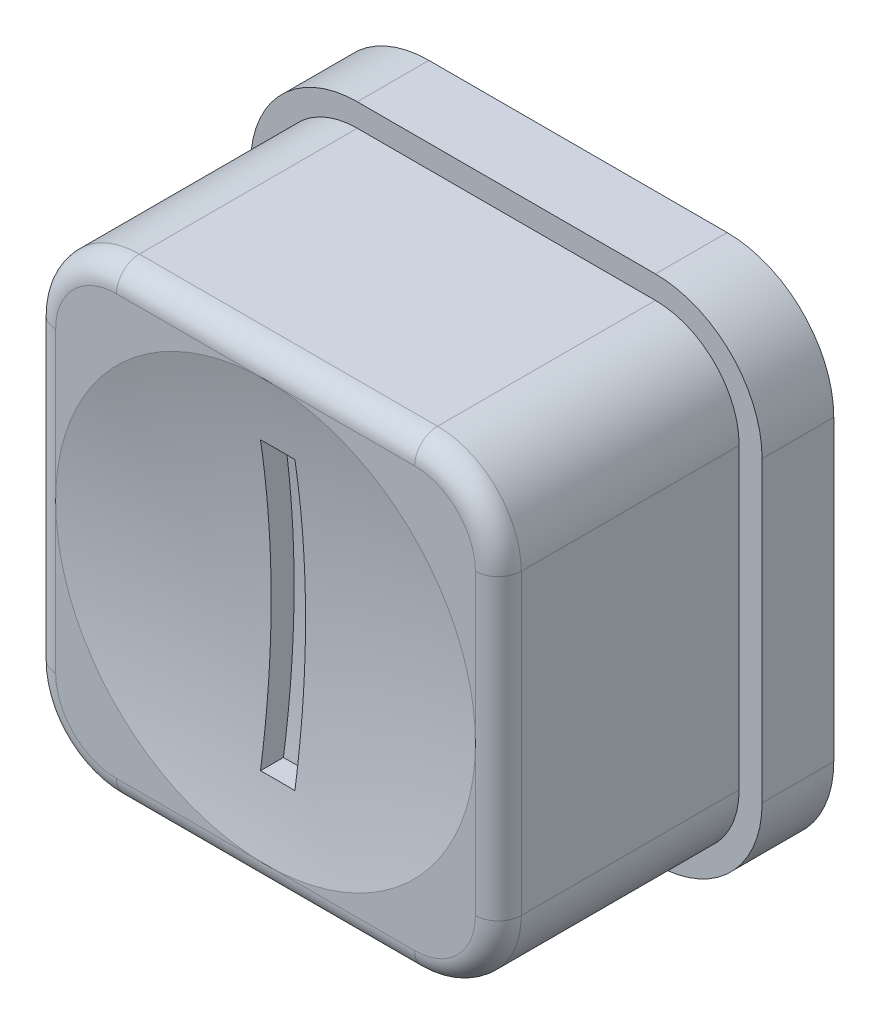
ISO-10303-21;
HEADER;
FILE_DESCRIPTION(('STEP AP214'),'2;1');
FILE_NAME('part.step','',(''),(''),'','','');
FILE_SCHEMA(('AUTOMOTIVE_DESIGN { 1 0 10303 214 1 1 1 1 }'));
ENDSEC;
DATA;
#1=APPLICATION_CONTEXT('core data for automotive mechanical design processes');
#2=APPLICATION_PROTOCOL_DEFINITION('international standard','automotive_design',2000,#1);
#3=PRODUCT_CONTEXT('',#1,'mechanical');
#4=PRODUCT('Part','Part','',(#3));
#5=PRODUCT_RELATED_PRODUCT_CATEGORY('part','',(#4));
#6=PRODUCT_DEFINITION_FORMATION('','',#4);
#7=PRODUCT_DEFINITION_CONTEXT('part definition',#1,'design');
#8=PRODUCT_DEFINITION('design','',#6,#7);
#9=PRODUCT_DEFINITION_SHAPE('','',#8);
#10=(LENGTH_UNIT() NAMED_UNIT(*) SI_UNIT(.MILLI.,.METRE.));
#11=(NAMED_UNIT(*) PLANE_ANGLE_UNIT() SI_UNIT($,.RADIAN.));
#12=(NAMED_UNIT(*) SI_UNIT($,.STERADIAN.) SOLID_ANGLE_UNIT());
#13=UNCERTAINTY_MEASURE_WITH_UNIT(LENGTH_MEASURE(1.E-05),#10,'distance_accuracy_value','');
#14=(GEOMETRIC_REPRESENTATION_CONTEXT(3) GLOBAL_UNCERTAINTY_ASSIGNED_CONTEXT((#13)) GLOBAL_UNIT_ASSIGNED_CONTEXT((#10,
#11,#12)) REPRESENTATION_CONTEXT('',''));
#15=CARTESIAN_POINT('',(0.,0.,0.));
#16=DIRECTION('',(0.,0.,1.));
#17=DIRECTION('',(1.,0.,0.));
#18=AXIS2_PLACEMENT_3D('',#15,#16,#17);
#19=CARTESIAN_POINT('',(0.,0.,21.0115145788366));
#20=DIRECTION('',(0.,0.,-1.));
#21=DIRECTION('',(0.,1.,0.));
#22=AXIS2_PLACEMENT_3D('',#19,#20,#21);
#23=SPHERICAL_SURFACE('',#22,21.5195145788366);
#24=CARTESIAN_POINT('',(0.,0.,0.));
#25=DIRECTION('',(0.,0.,-1.));
#26=DIRECTION('',(0.,1.,0.));
#27=AXIS2_PLACEMENT_3D('',#24,#25,#26);
#28=CIRCLE('',#27,4.64819995397121);
#29=CARTESIAN_POINT('',(0.,4.64819995397121,0.));
#30=VERTEX_POINT('',#29);
#31=CARTESIAN_POINT('',(4.64819995397122,0.,0.));
#32=VERTEX_POINT('',#31);
#33=EDGE_CURVE('E410',#30,#32,#28,.T.);
#34=ORIENTED_EDGE('',*,*,#33,.F.);
#35=CARTESIAN_POINT('',(-4.64819995381655,0.,0.));
#36=VERTEX_POINT('',#35);
#37=EDGE_CURVE('E231',#36,#30,#28,.T.);
#38=ORIENTED_EDGE('',*,*,#37,.F.);
#39=CARTESIAN_POINT('',(0.,-4.64819995397122,0.));
#40=VERTEX_POINT('',#39);
#41=EDGE_CURVE('E62',#40,#36,#28,.T.);
#42=ORIENTED_EDGE('',*,*,#41,.F.);
#43=EDGE_CURVE('E413',#32,#40,#28,.T.);
#44=ORIENTED_EDGE('',*,*,#43,.F.);
#45=EDGE_LOOP('',(#34,#38,#42,#44));
#46=FACE_BOUND('',#45,.T.);
#47=CARTESIAN_POINT('',(0.,3.175,21.0115145788366));
#48=DIRECTION('',(0.,1.,0.));
#49=DIRECTION('',(0.,0.,1.));
#50=AXIS2_PLACEMENT_3D('',#47,#48,#49);
#51=CIRCLE('',#50,21.2840053258018);
#52=CARTESIAN_POINT('',(0.381,3.175,-0.269080377807843));
#53=VERTEX_POINT('',#52);
#54=CARTESIAN_POINT('',(-0.381,3.175,-0.269080377807842));
#55=VERTEX_POINT('',#54);
#56=EDGE_CURVE('E54',#53,#55,#51,.T.);
#57=ORIENTED_EDGE('',*,*,#56,.F.);
#58=CARTESIAN_POINT('',(0.381,0.,21.0115145788366));
#59=DIRECTION('',(1.,0.,0.));
#60=DIRECTION('',(0.,0.,-1.));
#61=AXIS2_PLACEMENT_3D('',#58,#59,#60);
#62=CIRCLE('',#61,21.5161415385928);
#63=CARTESIAN_POINT('',(0.380999999999998,-3.175,-0.269080377807844));
#64=VERTEX_POINT('',#63);
#65=EDGE_CURVE('E235',#64,#53,#62,.T.);
#66=ORIENTED_EDGE('',*,*,#65,.F.);
#67=CARTESIAN_POINT('',(-0.381000000000002,-3.17499999999997,-0.269080377807845));
#68=CARTESIAN_POINT('',(0.,-3.17499999999999,-0.275901662658938));
#69=CARTESIAN_POINT('',(0.380999999999997,-3.175,-0.269080377807845));
#70=B_SPLINE_CURVE_WITH_KNOTS('',2,(#67,#68,#69),.UNSPECIFIED.,.F.,.F.,(3,3),(0.,1.),.UNSPECIFIED.);
#71=CARTESIAN_POINT('',(-0.381000000000001,-3.17499999999998,-0.269080377807845));
#72=VERTEX_POINT('',#71);
#73=EDGE_CURVE('E218',#72,#64,#70,.T.);
#74=ORIENTED_EDGE('',*,*,#73,.F.);
#75=CARTESIAN_POINT('',(-0.381,0.,21.0115145788366));
#76=DIRECTION('',(-1.,0.,0.));
#77=DIRECTION('',(0.,0.,1.));
#78=AXIS2_PLACEMENT_3D('',#75,#76,#77);
#79=CIRCLE('',#78,21.5161415385928);
#80=EDGE_CURVE('E227',#55,#72,#79,.T.);
#81=ORIENTED_EDGE('',*,*,#80,.F.);
#82=EDGE_LOOP('',(#57,#66,#74,#81));
#83=FACE_BOUND('',#82,.T.);
#84=ADVANCED_FACE('F35',(#46,#83),#23,.F.);
#85=CARTESIAN_POINT('',(3.30199995397122,3.30199995397122,0.));
#86=DIRECTION('',(0.,0.,1.));
#87=DIRECTION('',(1.,0.,0.));
#88=AXIS2_PLACEMENT_3D('',#85,#86,#87);
#89=PLANE('',#88);
#90=ORIENTED_EDGE('',*,*,#33,.T.);
#91=DIRECTION('',(0.,1.,0.));
#92=VECTOR('',#91,1.);
#93=CARTESIAN_POINT('',(4.64819995397122,3.30199995397122,0.));
#94=LINE('',#93,#92);
#95=CARTESIAN_POINT('',(4.64819995397121,3.30199995397121,0.));
#96=VERTEX_POINT('',#95);
#97=EDGE_CURVE('E279',#32,#96,#94,.T.);
#98=ORIENTED_EDGE('',*,*,#97,.T.);
#99=CARTESIAN_POINT('',(3.30199995397122,3.30199995397122,0.));
#100=DIRECTION('',(0.,0.,1.));
#101=DIRECTION('',(1.,0.,0.));
#102=AXIS2_PLACEMENT_3D('',#99,#100,#101);
#103=CIRCLE('',#102,1.34619999999999);
#104=CARTESIAN_POINT('',(3.30199995397122,4.64819995397122,0.));
#105=VERTEX_POINT('',#104);
#106=EDGE_CURVE('E298',#96,#105,#103,.T.);
#107=ORIENTED_EDGE('',*,*,#106,.T.);
#108=DIRECTION('',(-1.,0.,0.));
#109=VECTOR('',#108,1.);
#110=CARTESIAN_POINT('',(3.30199995397122,4.64819995397121,0.));
#111=LINE('',#110,#109);
#112=EDGE_CURVE('E294',#105,#30,#111,.T.);
#113=ORIENTED_EDGE('',*,*,#112,.T.);
#114=EDGE_LOOP('',(#90,#98,#107,#113));
#115=FACE_BOUND('',#114,.T.);
#116=ADVANCED_FACE('F477',(#115),#89,.T.);
#117=ORIENTED_EDGE('',*,*,#37,.T.);
#118=CARTESIAN_POINT('',(-3.30199995397122,4.64819995397121,0.));
#119=VERTEX_POINT('',#118);
#120=EDGE_CURVE('E297',#30,#119,#111,.T.);
#121=ORIENTED_EDGE('',*,*,#120,.T.);
#122=CARTESIAN_POINT('',(-3.30199995397122,3.30199995397122,0.));
#123=DIRECTION('',(0.,0.,1.));
#124=DIRECTION('',(1.,0.,0.));
#125=AXIS2_PLACEMENT_3D('',#122,#123,#124);
#126=CIRCLE('',#125,1.34619999992266);
#127=CARTESIAN_POINT('',(-4.64819995389387,3.30199995397122,0.));
#128=VERTEX_POINT('',#127);
#129=EDGE_CURVE('E292',#119,#128,#126,.T.);
#130=ORIENTED_EDGE('',*,*,#129,.T.);
#131=DIRECTION('',(0.,-1.,0.));
#132=VECTOR('',#131,1.);
#133=CARTESIAN_POINT('',(-4.64819995381655,3.30199995397122,0.));
#134=LINE('',#133,#132);
#135=EDGE_CURVE('E288',#128,#36,#134,.T.);
#136=ORIENTED_EDGE('',*,*,#135,.T.);
#137=EDGE_LOOP('',(#117,#121,#130,#136));
#138=FACE_BOUND('',#137,.T.);
#139=ADVANCED_FACE('F620',(#138),#89,.T.);
#140=ORIENTED_EDGE('',*,*,#41,.T.);
#141=CARTESIAN_POINT('',(-4.64819995381654,-3.30199995397122,0.));
#142=VERTEX_POINT('',#141);
#143=EDGE_CURVE('E291',#36,#142,#134,.T.);
#144=ORIENTED_EDGE('',*,*,#143,.T.);
#145=CARTESIAN_POINT('',(-3.30199995397122,-3.30199995397122,0.));
#146=DIRECTION('',(0.,0.,1.));
#147=DIRECTION('',(1.,0.,0.));
#148=AXIS2_PLACEMENT_3D('',#145,#146,#147);
#149=CIRCLE('',#148,1.34619999992266);
#150=CARTESIAN_POINT('',(-3.30199995397122,-4.64819995389388,0.));
#151=VERTEX_POINT('',#150);
#152=EDGE_CURVE('E286',#142,#151,#149,.T.);
#153=ORIENTED_EDGE('',*,*,#152,.T.);
#154=DIRECTION('',(1.,0.,0.));
#155=VECTOR('',#154,1.);
#156=CARTESIAN_POINT('',(3.3019999539712,-4.64819995397123,0.));
#157=LINE('',#156,#155);
#158=EDGE_CURVE('E282',#151,#40,#157,.T.);
#159=ORIENTED_EDGE('',*,*,#158,.T.);
#160=EDGE_LOOP('',(#140,#144,#153,#159));
#161=FACE_BOUND('',#160,.T.);
#162=ADVANCED_FACE('F531',(#161),#89,.T.);
#163=CARTESIAN_POINT('',(3.30199995397122,3.30199995397122,-5.334));
#164=DIRECTION('',(0.,0.,1.));
#165=DIRECTION('',(1.,0.,0.));
#166=AXIS2_PLACEMENT_3D('',#163,#164,#165);
#167=CYLINDRICAL_SURFACE('',#166,1.85419999999999);
#168=DIRECTION('',(0.,0.,1.));
#169=VECTOR('',#168,1.);
#170=CARTESIAN_POINT('',(3.30199995397122,5.15619995397121,-5.334));
#171=LINE('',#170,#169);
#172=CARTESIAN_POINT('',(3.30199995397122,5.15619995397121,-5.334));
#173=VERTEX_POINT('',#172);
#174=CARTESIAN_POINT('',(3.30199995397122,5.15619995397121,-0.508));
#175=VERTEX_POINT('',#174);
#176=EDGE_CURVE('E301',#173,#175,#171,.T.);
#177=ORIENTED_EDGE('',*,*,#176,.T.);
#178=CARTESIAN_POINT('',(3.30199995397122,3.30199995397122,-0.508));
#179=DIRECTION('',(0.,0.,1.));
#180=DIRECTION('',(1.,0.,0.));
#181=AXIS2_PLACEMENT_3D('',#178,#179,#180);
#182=CIRCLE('',#181,1.85419999999999);
#183=CARTESIAN_POINT('',(5.15619995397122,3.30199995397121,-0.508));
#184=VERTEX_POINT('',#183);
#185=EDGE_CURVE('E11',#175,#184,#182,.F.);
#186=ORIENTED_EDGE('',*,*,#185,.T.);
#187=DIRECTION('',(0.,0.,1.));
#188=VECTOR('',#187,1.);
#189=CARTESIAN_POINT('',(5.15619995397122,3.30199995397121,-5.334));
#190=LINE('',#189,#188);
#191=CARTESIAN_POINT('',(5.15619995397122,3.30199995397121,-5.334));
#192=VERTEX_POINT('',#191);
#193=EDGE_CURVE('E300',#192,#184,#190,.T.);
#194=ORIENTED_EDGE('',*,*,#193,.F.);
#195=CARTESIAN_POINT('',(3.30199995397122,3.30199995397122,-5.334));
#196=DIRECTION('',(0.,0.,1.));
#197=DIRECTION('',(1.,0.,0.));
#198=AXIS2_PLACEMENT_3D('',#195,#196,#197);
#199=CIRCLE('',#198,1.85419999999999);
#200=EDGE_CURVE('E240',#192,#173,#199,.T.);
#201=ORIENTED_EDGE('',*,*,#200,.T.);
#202=EDGE_LOOP('',(#177,#186,#194,#201));
#203=FACE_BOUND('',#202,.T.);
#204=ADVANCED_FACE('F536',(#203),#167,.T.);
#205=CARTESIAN_POINT('',(5.15619995397122,-3.30199995397122,-5.334));
#206=DIRECTION('',(1.,0.,0.));
#207=DIRECTION('',(0.,0.,-1.));
#208=AXIS2_PLACEMENT_3D('',#205,#206,#207);
#209=PLANE('',#208);
#210=ORIENTED_EDGE('',*,*,#193,.T.);
#211=DIRECTION('',(0.,1.,0.));
#212=VECTOR('',#211,1.);
#213=CARTESIAN_POINT('',(5.15619995397122,-3.30199995397122,-0.508));
#214=LINE('',#213,#212);
#215=CARTESIAN_POINT('',(5.15619995397122,-3.30199995397122,-0.508));
#216=VERTEX_POINT('',#215);
#217=EDGE_CURVE('E273',#184,#216,#214,.F.);
#218=ORIENTED_EDGE('',*,*,#217,.T.);
#219=DIRECTION('',(0.,0.,1.));
#220=VECTOR('',#219,1.);
#221=CARTESIAN_POINT('',(5.15619995397122,-3.30199995397122,-5.334));
#222=LINE('',#221,#220);
#223=CARTESIAN_POINT('',(5.15619995397122,-3.30199995397122,-5.334));
#224=VERTEX_POINT('',#223);
#225=EDGE_CURVE('E320',#224,#216,#222,.T.);
#226=ORIENTED_EDGE('',*,*,#225,.F.);
#227=DIRECTION('',(0.,1.,0.));
#228=VECTOR('',#227,1.);
#229=CARTESIAN_POINT('',(5.15619995397122,-3.30199995397122,-5.334));
#230=LINE('',#229,#228);
#231=EDGE_CURVE('E305',#224,#192,#230,.T.);
#232=ORIENTED_EDGE('',*,*,#231,.T.);
#233=EDGE_LOOP('',(#210,#218,#226,#232));
#234=FACE_BOUND('',#233,.T.);
#235=ADVANCED_FACE('F532',(#234),#209,.T.);
#236=CARTESIAN_POINT('',(3.30199995397122,-3.30199995397122,-5.334));
#237=DIRECTION('',(0.,0.,1.));
#238=DIRECTION('',(1.,0.,0.));
#239=AXIS2_PLACEMENT_3D('',#236,#237,#238);
#240=CYLINDRICAL_SURFACE('',#239,1.8542);
#241=ORIENTED_EDGE('',*,*,#225,.T.);
#242=CARTESIAN_POINT('',(3.30199995397122,-3.30199995397122,-0.508));
#243=DIRECTION('',(0.,0.,1.));
#244=DIRECTION('',(1.,0.,0.));
#245=AXIS2_PLACEMENT_3D('',#242,#243,#244);
#246=CIRCLE('',#245,1.8542);
#247=CARTESIAN_POINT('',(3.30199995397122,-5.15619995397123,-0.508));
#248=VERTEX_POINT('',#247);
#249=EDGE_CURVE('E271',#216,#248,#246,.F.);
#250=ORIENTED_EDGE('',*,*,#249,.T.);
#251=DIRECTION('',(0.,0.,1.));
#252=VECTOR('',#251,1.);
#253=CARTESIAN_POINT('',(3.30199995397122,-5.15619995397123,-5.334));
#254=LINE('',#253,#252);
#255=CARTESIAN_POINT('',(3.30199995397122,-5.15619995397123,-5.334));
#256=VERTEX_POINT('',#255);
#257=EDGE_CURVE('E317',#256,#248,#254,.T.);
#258=ORIENTED_EDGE('',*,*,#257,.F.);
#259=CARTESIAN_POINT('',(3.30199995397122,-3.30199995397122,-5.334));
#260=DIRECTION('',(0.,0.,1.));
#261=DIRECTION('',(1.,0.,0.));
#262=AXIS2_PLACEMENT_3D('',#259,#260,#261);
#263=CIRCLE('',#262,1.8542);
#264=EDGE_CURVE('E327',#256,#224,#263,.T.);
#265=ORIENTED_EDGE('',*,*,#264,.T.);
#266=EDGE_LOOP('',(#241,#250,#258,#265));
#267=FACE_BOUND('',#266,.T.);
#268=ADVANCED_FACE('F535',(#267),#240,.T.);
#269=CARTESIAN_POINT('',(-3.30199995397122,-5.15619995397121,-5.334));
#270=DIRECTION('',(0.,-1.,0.));
#271=DIRECTION('',(1.,0.,0.));
#272=AXIS2_PLACEMENT_3D('',#269,#270,#271);
#273=PLANE('',#272);
#274=ORIENTED_EDGE('',*,*,#257,.T.);
#275=DIRECTION('',(1.,0.,0.));
#276=VECTOR('',#275,1.);
#277=CARTESIAN_POINT('',(-3.30199995397122,-5.15619995397121,-0.508));
#278=LINE('',#277,#276);
#279=CARTESIAN_POINT('',(-3.30199995397122,-5.15619995389388,-0.508));
#280=VERTEX_POINT('',#279);
#281=EDGE_CURVE('E269',#248,#280,#278,.F.);
#282=ORIENTED_EDGE('',*,*,#281,.T.);
#283=DIRECTION('',(0.,0.,1.));
#284=VECTOR('',#283,1.);
#285=CARTESIAN_POINT('',(-3.30199995397122,-5.15619995389388,-5.334));
#286=LINE('',#285,#284);
#287=CARTESIAN_POINT('',(-3.30199995397122,-5.15619995389388,-5.334));
#288=VERTEX_POINT('',#287);
#289=EDGE_CURVE('E314',#288,#280,#286,.T.);
#290=ORIENTED_EDGE('',*,*,#289,.F.);
#291=DIRECTION('',(1.,0.,0.));
#292=VECTOR('',#291,1.);
#293=CARTESIAN_POINT('',(-3.30199995397122,-5.15619995397121,-5.334));
#294=LINE('',#293,#292);
#295=EDGE_CURVE('E330',#288,#256,#294,.T.);
#296=ORIENTED_EDGE('',*,*,#295,.T.);
#297=EDGE_LOOP('',(#274,#282,#290,#296));
#298=FACE_BOUND('',#297,.T.);
#299=ADVANCED_FACE('F540',(#298),#273,.T.);
#300=CARTESIAN_POINT('',(-3.30199995397122,-3.30199995397122,-5.334));
#301=DIRECTION('',(0.,0.,1.));
#302=DIRECTION('',(1.,0.,0.));
#303=AXIS2_PLACEMENT_3D('',#300,#301,#302);
#304=CYLINDRICAL_SURFACE('',#303,1.85419999992266);
#305=ORIENTED_EDGE('',*,*,#289,.T.);
#306=CARTESIAN_POINT('',(-3.30199995397122,-3.30199995397122,-0.508));
#307=DIRECTION('',(0.,0.,1.));
#308=DIRECTION('',(1.,0.,0.));
#309=AXIS2_PLACEMENT_3D('',#306,#307,#308);
#310=CIRCLE('',#309,1.85419999992266);
#311=CARTESIAN_POINT('',(-5.15619995381654,-3.30199995397122,-0.508));
#312=VERTEX_POINT('',#311);
#313=EDGE_CURVE('E267',#280,#312,#310,.F.);
#314=ORIENTED_EDGE('',*,*,#313,.T.);
#315=DIRECTION('',(0.,0.,1.));
#316=VECTOR('',#315,1.);
#317=CARTESIAN_POINT('',(-5.15619995381654,-3.30199995397122,-5.334));
#318=LINE('',#317,#316);
#319=CARTESIAN_POINT('',(-5.15619995381654,-3.30199995397122,-5.334));
#320=VERTEX_POINT('',#319);
#321=EDGE_CURVE('E311',#320,#312,#318,.T.);
#322=ORIENTED_EDGE('',*,*,#321,.F.);
#323=CARTESIAN_POINT('',(-3.30199995397122,-3.30199995397122,-5.334));
#324=DIRECTION('',(0.,0.,1.));
#325=DIRECTION('',(1.,0.,0.));
#326=AXIS2_PLACEMENT_3D('',#323,#324,#325);
#327=CIRCLE('',#326,1.85419999992266);
#328=EDGE_CURVE('E333',#320,#288,#327,.T.);
#329=ORIENTED_EDGE('',*,*,#328,.T.);
#330=EDGE_LOOP('',(#305,#314,#322,#329));
#331=FACE_BOUND('',#330,.T.);
#332=ADVANCED_FACE('F544',(#331),#304,.T.);
#333=CARTESIAN_POINT('',(-5.15619995381655,3.30199995397122,-5.334));
#334=DIRECTION('',(-1.,0.,0.));
#335=DIRECTION('',(0.,-1.,0.));
#336=AXIS2_PLACEMENT_3D('',#333,#334,#335);
#337=PLANE('',#336);
#338=ORIENTED_EDGE('',*,*,#321,.T.);
#339=DIRECTION('',(0.,-1.,0.));
#340=VECTOR('',#339,1.);
#341=CARTESIAN_POINT('',(-5.15619995381655,3.30199995397122,-0.508));
#342=LINE('',#341,#340);
#343=CARTESIAN_POINT('',(-5.15619995389387,3.30199995397122,-0.508));
#344=VERTEX_POINT('',#343);
#345=EDGE_CURVE('E265',#312,#344,#342,.F.);
#346=ORIENTED_EDGE('',*,*,#345,.T.);
#347=DIRECTION('',(0.,0.,1.));
#348=VECTOR('',#347,1.);
#349=CARTESIAN_POINT('',(-5.15619995389387,3.30199995397122,-5.334));
#350=LINE('',#349,#348);
#351=CARTESIAN_POINT('',(-5.15619995389387,3.30199995397122,-5.334));
#352=VERTEX_POINT('',#351);
#353=EDGE_CURVE('E308',#352,#344,#350,.T.);
#354=ORIENTED_EDGE('',*,*,#353,.F.);
#355=DIRECTION('',(0.,-1.,0.));
#356=VECTOR('',#355,1.);
#357=CARTESIAN_POINT('',(-5.15619995381655,3.30199995397122,-5.334));
#358=LINE('',#357,#356);
#359=EDGE_CURVE('E336',#352,#320,#358,.T.);
#360=ORIENTED_EDGE('',*,*,#359,.T.);
#361=EDGE_LOOP('',(#338,#346,#354,#360));
#362=FACE_BOUND('',#361,.T.);
#363=ADVANCED_FACE('F548',(#362),#337,.T.);
#364=CARTESIAN_POINT('',(-3.30199995397122,3.30199995397122,-5.334));
#365=DIRECTION('',(0.,0.,1.));
#366=DIRECTION('',(1.,0.,0.));
#367=AXIS2_PLACEMENT_3D('',#364,#365,#366);
#368=CYLINDRICAL_SURFACE('',#367,1.85419999992266);
#369=ORIENTED_EDGE('',*,*,#353,.T.);
#370=CARTESIAN_POINT('',(-3.30199995397122,3.30199995397122,-0.508));
#371=DIRECTION('',(0.,0.,1.));
#372=DIRECTION('',(1.,0.,0.));
#373=AXIS2_PLACEMENT_3D('',#370,#371,#372);
#374=CIRCLE('',#373,1.85419999992266);
#375=CARTESIAN_POINT('',(-3.30199995397122,5.15619995397121,-0.508));
#376=VERTEX_POINT('',#375);
#377=EDGE_CURVE('E263',#344,#376,#374,.F.);
#378=ORIENTED_EDGE('',*,*,#377,.T.);
#379=DIRECTION('',(0.,0.,1.));
#380=VECTOR('',#379,1.);
#381=CARTESIAN_POINT('',(-3.30199995397122,5.15619995397121,-5.334));
#382=LINE('',#381,#380);
#383=CARTESIAN_POINT('',(-3.30199995397122,5.15619995397121,-5.334));
#384=VERTEX_POINT('',#383);
#385=EDGE_CURVE('E304',#384,#376,#382,.T.);
#386=ORIENTED_EDGE('',*,*,#385,.F.);
#387=CARTESIAN_POINT('',(-3.30199995397122,3.30199995397122,-5.334));
#388=DIRECTION('',(0.,0.,1.));
#389=DIRECTION('',(1.,0.,0.));
#390=AXIS2_PLACEMENT_3D('',#387,#388,#389);
#391=CIRCLE('',#390,1.85419999992266);
#392=EDGE_CURVE('E339',#384,#352,#391,.T.);
#393=ORIENTED_EDGE('',*,*,#392,.T.);
#394=EDGE_LOOP('',(#369,#378,#386,#393));
#395=FACE_BOUND('',#394,.T.);
#396=ADVANCED_FACE('F552',(#395),#368,.T.);
#397=CARTESIAN_POINT('',(3.30199995397122,5.15619995397121,-5.334));
#398=DIRECTION('',(0.,1.,0.));
#399=DIRECTION('',(-1.,0.,0.));
#400=AXIS2_PLACEMENT_3D('',#397,#398,#399);
#401=PLANE('',#400);
#402=ORIENTED_EDGE('',*,*,#385,.T.);
#403=DIRECTION('',(-1.,0.,0.));
#404=VECTOR('',#403,1.);
#405=CARTESIAN_POINT('',(3.30199995397122,5.15619995397121,-0.508));
#406=LINE('',#405,#404);
#407=EDGE_CURVE('E46',#376,#175,#406,.F.);
#408=ORIENTED_EDGE('',*,*,#407,.T.);
#409=ORIENTED_EDGE('',*,*,#176,.F.);
#410=DIRECTION('',(-1.,0.,0.));
#411=VECTOR('',#410,1.);
#412=CARTESIAN_POINT('',(3.30199995397122,5.15619995397121,-5.334));
#413=LINE('',#412,#411);
#414=EDGE_CURVE('E342',#173,#384,#413,.T.);
#415=ORIENTED_EDGE('',*,*,#414,.T.);
#416=EDGE_LOOP('',(#402,#408,#409,#415));
#417=FACE_BOUND('',#416,.T.);
#418=ADVANCED_FACE('F529',(#417),#401,.T.);
#419=ORIENTED_EDGE('',*,*,#43,.T.);
#420=CARTESIAN_POINT('',(3.30199995397122,-4.64819995397123,0.));
#421=VERTEX_POINT('',#420);
#422=EDGE_CURVE('E285',#40,#421,#157,.T.);
#423=ORIENTED_EDGE('',*,*,#422,.T.);
#424=CARTESIAN_POINT('',(3.30199995397122,-3.30199995397122,0.));
#425=DIRECTION('',(0.,0.,1.));
#426=DIRECTION('',(1.,0.,0.));
#427=AXIS2_PLACEMENT_3D('',#424,#425,#426);
#428=CIRCLE('',#427,1.3462);
#429=CARTESIAN_POINT('',(4.64819995397122,-3.30199995397122,0.));
#430=VERTEX_POINT('',#429);
#431=EDGE_CURVE('E280',#421,#430,#428,.T.);
#432=ORIENTED_EDGE('',*,*,#431,.T.);
#433=EDGE_CURVE('E276',#430,#32,#94,.T.);
#434=ORIENTED_EDGE('',*,*,#433,.T.);
#435=EDGE_LOOP('',(#419,#423,#432,#434));
#436=FACE_BOUND('',#435,.T.);
#437=ADVANCED_FACE('F526',(#436),#89,.T.);
#438=CARTESIAN_POINT('',(-4.64819995381655,3.30199995397122,-0.508));
#439=DIRECTION('',(0.,-1.,0.));
#440=DIRECTION('',(1.,0.,0.));
#441=AXIS2_PLACEMENT_3D('',#438,#439,#440);
#442=CYLINDRICAL_SURFACE('',#441,0.508);
#443=CARTESIAN_POINT('',(-4.64819995381655,3.30199995397122,-0.508));
#444=DIRECTION('',(0.,1.,0.));
#445=DIRECTION('',(0.,0.,1.));
#446=AXIS2_PLACEMENT_3D('',#443,#444,#445);
#447=CIRCLE('',#446,0.508);
#448=EDGE_CURVE('E241',#344,#128,#447,.T.);
#449=ORIENTED_EDGE('',*,*,#448,.F.);
#450=ORIENTED_EDGE('',*,*,#345,.F.);
#451=CARTESIAN_POINT('',(-4.64819995381654,-3.30199995397122,-0.508));
#452=DIRECTION('',(0.,-1.,0.));
#453=DIRECTION('',(1.,0.,0.));
#454=AXIS2_PLACEMENT_3D('',#451,#452,#453);
#455=CIRCLE('',#454,0.508);
#456=EDGE_CURVE('E237',#142,#312,#455,.T.);
#457=ORIENTED_EDGE('',*,*,#456,.F.);
#458=ORIENTED_EDGE('',*,*,#143,.F.);
#459=ORIENTED_EDGE('',*,*,#135,.F.);
#460=EDGE_LOOP('',(#449,#450,#457,#458,#459));
#461=FACE_BOUND('',#460,.T.);
#462=ADVANCED_FACE('F37',(#461),#442,.T.);
#463=CARTESIAN_POINT('',(-3.30199995397122,-3.30199995397122,-0.508));
#464=DIRECTION('',(0.,0.,1.));
#465=DIRECTION('',(1.,0.,0.));
#466=AXIS2_PLACEMENT_3D('',#463,#464,#465);
#467=TOROIDAL_SURFACE('',#466,1.34619999992266,0.508);
#468=ORIENTED_EDGE('',*,*,#456,.T.);
#469=ORIENTED_EDGE('',*,*,#313,.F.);
#470=CARTESIAN_POINT('',(-3.30199995397122,-4.64819995389388,-0.508));
#471=DIRECTION('',(1.,0.,0.));
#472=DIRECTION('',(0.,1.,0.));
#473=AXIS2_PLACEMENT_3D('',#470,#471,#472);
#474=CIRCLE('',#473,0.508);
#475=EDGE_CURVE('E244',#151,#280,#474,.T.);
#476=ORIENTED_EDGE('',*,*,#475,.F.);
#477=ORIENTED_EDGE('',*,*,#152,.F.);
#478=EDGE_LOOP('',(#468,#469,#476,#477));
#479=FACE_BOUND('',#478,.T.);
#480=ADVANCED_FACE('F584',(#479),#467,.T.);
#481=CARTESIAN_POINT('',(-3.30199995397122,3.30199995397122,-0.508));
#482=DIRECTION('',(0.,0.,1.));
#483=DIRECTION('',(1.,0.,0.));
#484=AXIS2_PLACEMENT_3D('',#481,#482,#483);
#485=TOROIDAL_SURFACE('',#484,1.34619999992266,0.508);
#486=ORIENTED_EDGE('',*,*,#448,.T.);
#487=ORIENTED_EDGE('',*,*,#129,.F.);
#488=CARTESIAN_POINT('',(-3.30199995397122,4.64819995389388,-0.508));
#489=DIRECTION('',(1.,0.,0.));
#490=DIRECTION('',(0.,1.,0.));
#491=AXIS2_PLACEMENT_3D('',#488,#489,#490);
#492=CIRCLE('',#491,0.508);
#493=EDGE_CURVE('E247',#376,#119,#492,.T.);
#494=ORIENTED_EDGE('',*,*,#493,.F.);
#495=ORIENTED_EDGE('',*,*,#377,.F.);
#496=EDGE_LOOP('',(#486,#487,#494,#495));
#497=FACE_BOUND('',#496,.T.);
#498=ADVANCED_FACE('F581',(#497),#485,.T.);
#499=CARTESIAN_POINT('',(3.3019999539712,-4.64819995397123,-0.508));
#500=DIRECTION('',(1.,0.,0.));
#501=DIRECTION('',(0.,1.,0.));
#502=AXIS2_PLACEMENT_3D('',#499,#500,#501);
#503=CYLINDRICAL_SURFACE('',#502,0.508);
#504=ORIENTED_EDGE('',*,*,#475,.T.);
#505=ORIENTED_EDGE('',*,*,#281,.F.);
#506=CARTESIAN_POINT('',(3.30199995397122,-4.64819995397123,-0.508));
#507=DIRECTION('',(1.,0.,0.));
#508=DIRECTION('',(0.,0.,-1.));
#509=AXIS2_PLACEMENT_3D('',#506,#507,#508);
#510=CIRCLE('',#509,0.508);
#511=EDGE_CURVE('E250',#421,#248,#510,.T.);
#512=ORIENTED_EDGE('',*,*,#511,.F.);
#513=ORIENTED_EDGE('',*,*,#422,.F.);
#514=ORIENTED_EDGE('',*,*,#158,.F.);
#515=EDGE_LOOP('',(#504,#505,#512,#513,#514));
#516=FACE_BOUND('',#515,.T.);
#517=ADVANCED_FACE('F577',(#516),#503,.T.);
#518=CARTESIAN_POINT('',(3.30199995397122,4.64819995397121,-0.508));
#519=DIRECTION('',(-1.,0.,0.));
#520=DIRECTION('',(0.,-1.,0.));
#521=AXIS2_PLACEMENT_3D('',#518,#519,#520);
#522=CYLINDRICAL_SURFACE('',#521,0.508);
#523=ORIENTED_EDGE('',*,*,#493,.T.);
#524=ORIENTED_EDGE('',*,*,#120,.F.);
#525=ORIENTED_EDGE('',*,*,#112,.F.);
#526=CARTESIAN_POINT('',(3.30199995397122,4.64819995397121,-0.508));
#527=DIRECTION('',(1.,0.,0.));
#528=DIRECTION('',(0.,1.,0.));
#529=AXIS2_PLACEMENT_3D('',#526,#527,#528);
#530=CIRCLE('',#529,0.508);
#531=EDGE_CURVE('E253',#175,#105,#530,.T.);
#532=ORIENTED_EDGE('',*,*,#531,.F.);
#533=ORIENTED_EDGE('',*,*,#407,.F.);
#534=EDGE_LOOP('',(#523,#524,#525,#532,#533));
#535=FACE_BOUND('',#534,.T.);
#536=ADVANCED_FACE('F573',(#535),#522,.T.);
#537=CARTESIAN_POINT('',(3.30199995397122,-3.30199995397122,-0.508));
#538=DIRECTION('',(0.,0.,1.));
#539=DIRECTION('',(1.,0.,0.));
#540=AXIS2_PLACEMENT_3D('',#537,#538,#539);
#541=TOROIDAL_SURFACE('',#540,1.3462,0.508);
#542=ORIENTED_EDGE('',*,*,#511,.T.);
#543=ORIENTED_EDGE('',*,*,#249,.F.);
#544=CARTESIAN_POINT('',(4.64819995397122,-3.30199995397122,-0.508));
#545=DIRECTION('',(0.,1.,0.));
#546=DIRECTION('',(0.,0.,1.));
#547=AXIS2_PLACEMENT_3D('',#544,#545,#546);
#548=CIRCLE('',#547,0.508);
#549=EDGE_CURVE('E256',#430,#216,#548,.T.);
#550=ORIENTED_EDGE('',*,*,#549,.F.);
#551=ORIENTED_EDGE('',*,*,#431,.F.);
#552=EDGE_LOOP('',(#542,#543,#550,#551));
#553=FACE_BOUND('',#552,.T.);
#554=ADVANCED_FACE('F569',(#553),#541,.T.);
#555=CARTESIAN_POINT('',(3.30199995397122,3.30199995397122,-0.508));
#556=DIRECTION('',(0.,0.,1.));
#557=DIRECTION('',(1.,0.,0.));
#558=AXIS2_PLACEMENT_3D('',#555,#556,#557);
#559=TOROIDAL_SURFACE('',#558,1.34619999999999,0.508);
#560=ORIENTED_EDGE('',*,*,#531,.T.);
#561=ORIENTED_EDGE('',*,*,#106,.F.);
#562=CARTESIAN_POINT('',(4.64819995397121,3.30199995397121,-0.508));
#563=DIRECTION('',(0.,-1.,0.));
#564=DIRECTION('',(0.,0.,-1.));
#565=AXIS2_PLACEMENT_3D('',#562,#563,#564);
#566=CIRCLE('',#565,0.508);
#567=EDGE_CURVE('E258',#184,#96,#566,.T.);
#568=ORIENTED_EDGE('',*,*,#567,.F.);
#569=ORIENTED_EDGE('',*,*,#185,.F.);
#570=EDGE_LOOP('',(#560,#561,#568,#569));
#571=FACE_BOUND('',#570,.T.);
#572=ADVANCED_FACE('F565',(#571),#559,.T.);
#573=CARTESIAN_POINT('',(4.64819995397122,3.30199995397122,-0.508));
#574=DIRECTION('',(0.,1.,0.));
#575=DIRECTION('',(0.,0.,1.));
#576=AXIS2_PLACEMENT_3D('',#573,#574,#575);
#577=CYLINDRICAL_SURFACE('',#576,0.508);
#578=ORIENTED_EDGE('',*,*,#549,.T.);
#579=ORIENTED_EDGE('',*,*,#217,.F.);
#580=ORIENTED_EDGE('',*,*,#567,.T.);
#581=ORIENTED_EDGE('',*,*,#97,.F.);
#582=ORIENTED_EDGE('',*,*,#433,.F.);
#583=EDGE_LOOP('',(#578,#579,#580,#581,#582));
#584=FACE_BOUND('',#583,.T.);
#585=ADVANCED_FACE('F524',(#584),#577,.T.);
#586=CARTESIAN_POINT('',(3.30199995397122,3.30199995397122,-6.9215));
#587=DIRECTION('',(0.,0.,1.));
#588=DIRECTION('',(1.,0.,0.));
#589=AXIS2_PLACEMENT_3D('',#586,#587,#588);
#590=CYLINDRICAL_SURFACE('',#589,2.36219999999999);
#591=CARTESIAN_POINT('',(3.30199995397122,3.30199995397122,-5.334));
#592=DIRECTION('',(0.,0.,-1.));
#593=DIRECTION('',(-1.,0.,0.));
#594=AXIS2_PLACEMENT_3D('',#591,#592,#593);
#595=CIRCLE('',#594,2.36219999999999);
#596=CARTESIAN_POINT('',(3.30199995397122,5.66419995397122,-5.334));
#597=VERTEX_POINT('',#596);
#598=CARTESIAN_POINT('',(5.66419995397121,3.30199995397121,-5.334));
#599=VERTEX_POINT('',#598);
#600=EDGE_CURVE('E386',#597,#599,#595,.T.);
#601=ORIENTED_EDGE('',*,*,#600,.T.);
#602=DIRECTION('',(0.,0.,1.));
#603=VECTOR('',#602,1.);
#604=CARTESIAN_POINT('',(5.66419995397121,3.30199995397121,-6.9215));
#605=LINE('',#604,#603);
#606=CARTESIAN_POINT('',(5.66419995397121,3.30199995397121,-6.9215));
#607=VERTEX_POINT('',#606);
#608=EDGE_CURVE('E260',#607,#599,#605,.T.);
#609=ORIENTED_EDGE('',*,*,#608,.F.);
#610=CARTESIAN_POINT('',(3.30199995397122,3.30199995397122,-6.9215));
#611=DIRECTION('',(0.,0.,-1.));
#612=DIRECTION('',(-1.,0.,0.));
#613=AXIS2_PLACEMENT_3D('',#610,#611,#612);
#614=CIRCLE('',#613,2.36219999999999);
#615=CARTESIAN_POINT('',(3.30199995397122,5.66419995397122,-6.9215));
#616=VERTEX_POINT('',#615);
#617=EDGE_CURVE('E373',#616,#607,#614,.T.);
#618=ORIENTED_EDGE('',*,*,#617,.F.);
#619=DIRECTION('',(0.,0.,1.));
#620=VECTOR('',#619,1.);
#621=CARTESIAN_POINT('',(3.30199995397122,5.66419995397122,-6.9215));
#622=LINE('',#621,#620);
#623=EDGE_CURVE('E367',#616,#597,#622,.T.);
#624=ORIENTED_EDGE('',*,*,#623,.T.);
#625=EDGE_LOOP('',(#601,#609,#618,#624));
#626=FACE_BOUND('',#625,.T.);
#627=ADVANCED_FACE('F520',(#626),#590,.T.);
#628=CARTESIAN_POINT('',(5.66419995397121,3.30199995397121,-6.9215));
#629=DIRECTION('',(-1.,0.,0.));
#630=DIRECTION('',(0.,-1.,0.));
#631=AXIS2_PLACEMENT_3D('',#628,#629,#630);
#632=PLANE('',#631);
#633=DIRECTION('',(0.,-1.,0.));
#634=VECTOR('',#633,1.);
#635=CARTESIAN_POINT('',(5.66419995397121,3.30199995397121,-5.334));
#636=LINE('',#635,#634);
#637=CARTESIAN_POINT('',(5.66419995397122,-3.30199995397122,-5.334));
#638=VERTEX_POINT('',#637);
#639=EDGE_CURVE('E384',#599,#638,#636,.T.);
#640=ORIENTED_EDGE('',*,*,#639,.T.);
#641=DIRECTION('',(0.,0.,1.));
#642=VECTOR('',#641,1.);
#643=CARTESIAN_POINT('',(5.66419995397122,-3.30199995397122,-6.9215));
#644=LINE('',#643,#642);
#645=CARTESIAN_POINT('',(5.66419995397122,-3.30199995397122,-6.9215));
#646=VERTEX_POINT('',#645);
#647=EDGE_CURVE('E349',#646,#638,#644,.T.);
#648=ORIENTED_EDGE('',*,*,#647,.F.);
#649=DIRECTION('',(0.,-1.,0.));
#650=VECTOR('',#649,1.);
#651=CARTESIAN_POINT('',(5.66419995397121,3.30199995397121,-6.9215));
#652=LINE('',#651,#650);
#653=EDGE_CURVE('E401',#607,#646,#652,.T.);
#654=ORIENTED_EDGE('',*,*,#653,.F.);
#655=ORIENTED_EDGE('',*,*,#608,.T.);
#656=EDGE_LOOP('',(#640,#648,#654,#655));
#657=FACE_BOUND('',#656,.T.);
#658=ADVANCED_FACE('F516',(#657),#632,.F.);
#659=CARTESIAN_POINT('',(3.30199995397122,-3.30199995397122,-6.9215));
#660=DIRECTION('',(0.,0.,1.));
#661=DIRECTION('',(1.,0.,0.));
#662=AXIS2_PLACEMENT_3D('',#659,#660,#661);
#663=CYLINDRICAL_SURFACE('',#662,2.3622);
#664=CARTESIAN_POINT('',(3.30199995397122,-3.30199995397122,-5.334));
#665=DIRECTION('',(0.,0.,-1.));
#666=DIRECTION('',(-1.,0.,0.));
#667=AXIS2_PLACEMENT_3D('',#664,#665,#666);
#668=CIRCLE('',#667,2.3622);
#669=CARTESIAN_POINT('',(3.30199995397122,-5.66419995397122,-5.334));
#670=VERTEX_POINT('',#669);
#671=EDGE_CURVE('E382',#638,#670,#668,.T.);
#672=ORIENTED_EDGE('',*,*,#671,.T.);
#673=DIRECTION('',(0.,0.,1.));
#674=VECTOR('',#673,1.);
#675=CARTESIAN_POINT('',(3.30199995397122,-5.66419995397122,-6.9215));
#676=LINE('',#675,#674);
#677=CARTESIAN_POINT('',(3.30199995397122,-5.66419995397122,-6.9215));
#678=VERTEX_POINT('',#677);
#679=EDGE_CURVE('E352',#678,#670,#676,.T.);
#680=ORIENTED_EDGE('',*,*,#679,.F.);
#681=CARTESIAN_POINT('',(3.30199995397122,-3.30199995397122,-6.9215));
#682=DIRECTION('',(0.,0.,-1.));
#683=DIRECTION('',(-1.,0.,0.));
#684=AXIS2_PLACEMENT_3D('',#681,#682,#683);
#685=CIRCLE('',#684,2.3622);
#686=EDGE_CURVE('E399',#646,#678,#685,.T.);
#687=ORIENTED_EDGE('',*,*,#686,.F.);
#688=ORIENTED_EDGE('',*,*,#647,.T.);
#689=EDGE_LOOP('',(#672,#680,#687,#688));
#690=FACE_BOUND('',#689,.T.);
#691=ADVANCED_FACE('F512',(#690),#663,.T.);
#692=CARTESIAN_POINT('',(3.30199995397122,-5.66419995397122,-6.9215));
#693=DIRECTION('',(1.17116163864684E-11,1.,0.));
#694=DIRECTION('',(-1.,1.17116163864684E-11,0.));
#695=AXIS2_PLACEMENT_3D('',#692,#693,#694);
#696=PLANE('',#695);
#697=DIRECTION('',(-1.,1.17116163864684E-11,0.));
#698=VECTOR('',#697,1.);
#699=CARTESIAN_POINT('',(3.30199995397122,-5.66419995397122,-5.334));
#700=LINE('',#699,#698);
#701=CARTESIAN_POINT('',(-3.30199995397717,-5.66419995387455,-5.334));
#702=VERTEX_POINT('',#701);
#703=EDGE_CURVE('E380',#670,#702,#700,.T.);
#704=ORIENTED_EDGE('',*,*,#703,.T.);
#705=DIRECTION('',(0.,0.,1.));
#706=VECTOR('',#705,1.);
#707=CARTESIAN_POINT('',(-3.30199995397717,-5.66419995387455,-6.9215));
#708=LINE('',#707,#706);
#709=CARTESIAN_POINT('',(-3.30199995397717,-5.66419995387455,-6.9215));
#710=VERTEX_POINT('',#709);
#711=EDGE_CURVE('E355',#710,#702,#708,.T.);
#712=ORIENTED_EDGE('',*,*,#711,.F.);
#713=DIRECTION('',(-1.,1.17116163864684E-11,0.));
#714=VECTOR('',#713,1.);
#715=CARTESIAN_POINT('',(3.30199995397122,-5.66419995397122,-6.9215));
#716=LINE('',#715,#714);
#717=EDGE_CURVE('E397',#678,#710,#716,.T.);
#718=ORIENTED_EDGE('',*,*,#717,.F.);
#719=ORIENTED_EDGE('',*,*,#679,.T.);
#720=EDGE_LOOP('',(#704,#712,#718,#719));
#721=FACE_BOUND('',#720,.T.);
#722=ADVANCED_FACE('F508',(#721),#696,.F.);
#723=CARTESIAN_POINT('',(-3.30199995397122,-3.30199995397122,-6.9215));
#724=DIRECTION('',(0.,0.,1.));
#725=DIRECTION('',(1.,0.,0.));
#726=AXIS2_PLACEMENT_3D('',#723,#724,#725);
#727=CYLINDRICAL_SURFACE('',#726,2.36219999990333);
#728=CARTESIAN_POINT('',(-3.30199995397122,-3.30199995397122,-5.334));
#729=DIRECTION('',(0.,0.,-1.));
#730=DIRECTION('',(-1.,0.,0.));
#731=AXIS2_PLACEMENT_3D('',#728,#729,#730);
#732=CIRCLE('',#731,2.36219999990333);
#733=CARTESIAN_POINT('',(-5.66419995385521,-3.30199995397122,-5.334));
#734=VERTEX_POINT('',#733);
#735=EDGE_CURVE('E378',#702,#734,#732,.T.);
#736=ORIENTED_EDGE('',*,*,#735,.T.);
#737=DIRECTION('',(0.,0.,1.));
#738=VECTOR('',#737,1.);
#739=CARTESIAN_POINT('',(-5.66419995385521,-3.30199995397122,-6.9215));
#740=LINE('',#739,#738);
#741=CARTESIAN_POINT('',(-5.66419995385521,-3.30199995397122,-6.9215));
#742=VERTEX_POINT('',#741);
#743=EDGE_CURVE('E358',#742,#734,#740,.T.);
#744=ORIENTED_EDGE('',*,*,#743,.F.);
#745=CARTESIAN_POINT('',(-3.30199995397122,-3.30199995397122,-6.9215));
#746=DIRECTION('',(0.,0.,-1.));
#747=DIRECTION('',(-1.,0.,0.));
#748=AXIS2_PLACEMENT_3D('',#745,#746,#747);
#749=CIRCLE('',#748,2.36219999990333);
#750=EDGE_CURVE('E395',#710,#742,#749,.T.);
#751=ORIENTED_EDGE('',*,*,#750,.F.);
#752=ORIENTED_EDGE('',*,*,#711,.T.);
#753=EDGE_LOOP('',(#736,#744,#751,#752));
#754=FACE_BOUND('',#753,.T.);
#755=ADVANCED_FACE('F504',(#754),#727,.T.);
#756=CARTESIAN_POINT('',(-5.66419995385521,-3.30199995397122,-6.9215));
#757=DIRECTION('',(1.,5.85456047419177E-12,0.));
#758=DIRECTION('',(-5.85456047419177E-12,1.,0.));
#759=AXIS2_PLACEMENT_3D('',#756,#757,#758);
#760=PLANE('',#759);
#761=DIRECTION('',(-5.85456047419177E-12,1.,0.));
#762=VECTOR('',#761,1.);
#763=CARTESIAN_POINT('',(-5.66419995385521,-3.30199995397122,-5.334));
#764=LINE('',#763,#762);
#765=CARTESIAN_POINT('',(-5.66419995391321,3.30199995396527,-5.334));
#766=VERTEX_POINT('',#765);
#767=EDGE_CURVE('E376',#734,#766,#764,.T.);
#768=ORIENTED_EDGE('',*,*,#767,.T.);
#769=DIRECTION('',(0.,0.,1.));
#770=VECTOR('',#769,1.);
#771=CARTESIAN_POINT('',(-5.66419995391321,3.30199995396527,-6.9215));
#772=LINE('',#771,#770);
#773=CARTESIAN_POINT('',(-5.66419995391321,3.30199995396527,-6.9215));
#774=VERTEX_POINT('',#773);
#775=EDGE_CURVE('E361',#774,#766,#772,.T.);
#776=ORIENTED_EDGE('',*,*,#775,.F.);
#777=DIRECTION('',(-5.85456047419177E-12,1.,0.));
#778=VECTOR('',#777,1.);
#779=CARTESIAN_POINT('',(-5.66419995385521,-3.30199995397122,-6.9215));
#780=LINE('',#779,#778);
#781=EDGE_CURVE('E393',#742,#774,#780,.T.);
#782=ORIENTED_EDGE('',*,*,#781,.F.);
#783=ORIENTED_EDGE('',*,*,#743,.T.);
#784=EDGE_LOOP('',(#768,#776,#782,#783));
#785=FACE_BOUND('',#784,.T.);
#786=ADVANCED_FACE('F500',(#785),#760,.F.);
#787=CARTESIAN_POINT('',(-3.30199995397122,3.30199995397122,-6.9215));
#788=DIRECTION('',(0.,0.,1.));
#789=DIRECTION('',(1.,0.,0.));
#790=AXIS2_PLACEMENT_3D('',#787,#788,#789);
#791=CYLINDRICAL_SURFACE('',#790,2.36219999994199);
#792=CARTESIAN_POINT('',(-3.30199995397122,3.30199995397122,-5.334));
#793=DIRECTION('',(0.,0.,-1.));
#794=DIRECTION('',(-1.,0.,0.));
#795=AXIS2_PLACEMENT_3D('',#792,#793,#794);
#796=CIRCLE('',#795,2.36219999994199);
#797=CARTESIAN_POINT('',(-3.30199995397122,5.66419995393254,-5.334));
#798=VERTEX_POINT('',#797);
#799=EDGE_CURVE('E374',#766,#798,#796,.T.);
#800=ORIENTED_EDGE('',*,*,#799,.T.);
#801=DIRECTION('',(0.,0.,1.));
#802=VECTOR('',#801,1.);
#803=CARTESIAN_POINT('',(-3.30199995397122,5.66419995393254,-6.9215));
#804=LINE('',#803,#802);
#805=CARTESIAN_POINT('',(-3.30199995397122,5.66419995393254,-6.9215));
#806=VERTEX_POINT('',#805);
#807=EDGE_CURVE('E364',#806,#798,#804,.T.);
#808=ORIENTED_EDGE('',*,*,#807,.F.);
#809=CARTESIAN_POINT('',(-3.30199995397122,3.30199995397122,-6.9215));
#810=DIRECTION('',(0.,0.,-1.));
#811=DIRECTION('',(-1.,0.,0.));
#812=AXIS2_PLACEMENT_3D('',#809,#810,#811);
#813=CIRCLE('',#812,2.36219999994199);
#814=EDGE_CURVE('E391',#774,#806,#813,.T.);
#815=ORIENTED_EDGE('',*,*,#814,.F.);
#816=ORIENTED_EDGE('',*,*,#775,.T.);
#817=EDGE_LOOP('',(#800,#808,#815,#816));
#818=FACE_BOUND('',#817,.T.);
#819=ADVANCED_FACE('F496',(#818),#791,.T.);
#820=CARTESIAN_POINT('',(-3.30199995397122,5.66419995393254,-6.9215));
#821=DIRECTION('',(5.85613654035866E-12,-1.,0.));
#822=DIRECTION('',(1.,5.85613654035866E-12,0.));
#823=AXIS2_PLACEMENT_3D('',#820,#821,#822);
#824=PLANE('',#823);
#825=DIRECTION('',(1.,5.85613654035866E-12,0.));
#826=VECTOR('',#825,1.);
#827=CARTESIAN_POINT('',(-3.30199995397122,5.66419995393254,-5.334));
#828=LINE('',#827,#826);
#829=EDGE_CURVE('E371',#798,#597,#828,.T.);
#830=ORIENTED_EDGE('',*,*,#829,.T.);
#831=ORIENTED_EDGE('',*,*,#623,.F.);
#832=DIRECTION('',(1.,5.85613654035866E-12,0.));
#833=VECTOR('',#832,1.);
#834=CARTESIAN_POINT('',(-3.30199995397122,5.66419995393254,-6.9215));
#835=LINE('',#834,#833);
#836=EDGE_CURVE('E370',#806,#616,#835,.T.);
#837=ORIENTED_EDGE('',*,*,#836,.F.);
#838=ORIENTED_EDGE('',*,*,#807,.T.);
#839=EDGE_LOOP('',(#830,#831,#837,#838));
#840=FACE_BOUND('',#839,.T.);
#841=ADVANCED_FACE('F489',(#840),#824,.F.);
#842=CARTESIAN_POINT('',(3.30199995397122,3.30199995397122,-6.9215));
#843=DIRECTION('',(0.,0.,-1.));
#844=DIRECTION('',(-1.,0.,0.));
#845=AXIS2_PLACEMENT_3D('',#842,#843,#844);
#846=PLANE('',#845);
#847=CARTESIAN_POINT('',(0.,0.,-6.9215));
#848=DIRECTION('',(0.,0.,-1.));
#849=DIRECTION('',(-1.,0.,0.));
#850=AXIS2_PLACEMENT_3D('',#847,#848,#849);
#851=CIRCLE('',#850,0.59054999999999);
#852=CARTESIAN_POINT('',(-0.59054999999999,0.,-6.9215));
#853=VERTEX_POINT('',#852);
#854=EDGE_CURVE('E407',#853,#853,#851,.T.);
#855=ORIENTED_EDGE('',*,*,#854,.F.);
#856=EDGE_LOOP('',(#855));
#857=FACE_BOUND('',#856,.T.);
#858=ORIENTED_EDGE('',*,*,#617,.T.);
#859=ORIENTED_EDGE('',*,*,#653,.T.);
#860=ORIENTED_EDGE('',*,*,#686,.T.);
#861=ORIENTED_EDGE('',*,*,#717,.T.);
#862=ORIENTED_EDGE('',*,*,#750,.T.);
#863=ORIENTED_EDGE('',*,*,#781,.T.);
#864=ORIENTED_EDGE('',*,*,#814,.T.);
#865=ORIENTED_EDGE('',*,*,#836,.T.);
#866=EDGE_LOOP('',(#858,#859,#860,#861,#862,#863,#864,#865));
#867=FACE_BOUND('',#866,.T.);
#868=ADVANCED_FACE('F486',(#857,#867),#846,.T.);
#869=CARTESIAN_POINT('',(3.30199995397122,3.30199995397122,-5.334));
#870=DIRECTION('',(0.,0.,-1.));
#871=DIRECTION('',(-1.,0.,0.));
#872=AXIS2_PLACEMENT_3D('',#869,#870,#871);
#873=PLANE('',#872);
#874=ORIENTED_EDGE('',*,*,#200,.F.);
#875=ORIENTED_EDGE('',*,*,#231,.F.);
#876=ORIENTED_EDGE('',*,*,#264,.F.);
#877=ORIENTED_EDGE('',*,*,#295,.F.);
#878=ORIENTED_EDGE('',*,*,#328,.F.);
#879=ORIENTED_EDGE('',*,*,#359,.F.);
#880=ORIENTED_EDGE('',*,*,#392,.F.);
#881=ORIENTED_EDGE('',*,*,#414,.F.);
#882=EDGE_LOOP('',(#874,#875,#876,#877,#878,#879,#880,#881));
#883=FACE_BOUND('',#882,.T.);
#884=ORIENTED_EDGE('',*,*,#600,.F.);
#885=ORIENTED_EDGE('',*,*,#829,.F.);
#886=ORIENTED_EDGE('',*,*,#799,.F.);
#887=ORIENTED_EDGE('',*,*,#767,.F.);
#888=ORIENTED_EDGE('',*,*,#735,.F.);
#889=ORIENTED_EDGE('',*,*,#703,.F.);
#890=ORIENTED_EDGE('',*,*,#671,.F.);
#891=ORIENTED_EDGE('',*,*,#639,.F.);
#892=EDGE_LOOP('',(#884,#885,#886,#887,#888,#889,#890,#891));
#893=FACE_BOUND('',#892,.T.);
#894=ADVANCED_FACE('F484',(#883,#893),#873,.F.);
#895=CARTESIAN_POINT('',(0.,0.,-1.8415));
#896=DIRECTION('',(0.,0.,1.));
#897=DIRECTION('',(1.,0.,0.));
#898=AXIS2_PLACEMENT_3D('',#895,#896,#897);
#899=PLANE('',#898);
#900=CARTESIAN_POINT('',(0.,0.,-1.8415));
#901=DIRECTION('',(0.,0.,-1.));
#902=DIRECTION('',(-1.,0.,0.));
#903=AXIS2_PLACEMENT_3D('',#900,#901,#902);
#904=CIRCLE('',#903,0.590549999999998);
#905=CARTESIAN_POINT('',(-0.590549999999998,0.,-1.8415));
#906=VERTEX_POINT('',#905);
#907=EDGE_CURVE('E389',#906,#906,#904,.T.);
#908=ORIENTED_EDGE('',*,*,#907,.T.);
#909=EDGE_LOOP('',(#908));
#910=FACE_BOUND('',#909,.T.);
#911=ADVANCED_FACE('F480',(#910),#899,.F.);
#912=CARTESIAN_POINT('',(0.,0.,-6.9215));
#913=DIRECTION('',(0.,0.,-1.));
#914=DIRECTION('',(-1.,0.,0.));
#915=AXIS2_PLACEMENT_3D('',#912,#913,#914);
#916=CYLINDRICAL_SURFACE('',#915,0.590549999999994);
#917=ORIENTED_EDGE('',*,*,#907,.F.);
#918=EDGE_LOOP('',(#917));
#919=FACE_BOUND('',#918,.T.);
#920=ORIENTED_EDGE('',*,*,#854,.T.);
#921=EDGE_LOOP('',(#920));
#922=FACE_BOUND('',#921,.T.);
#923=ADVANCED_FACE('F473',(#919,#922),#916,.F.);
#924=CARTESIAN_POINT('',(0.,0.,20.5035145788366));
#925=DIRECTION('',(0.,0.,-1.));
#926=DIRECTION('',(0.,1.,0.));
#927=AXIS2_PLACEMENT_3D('',#924,#925,#926);
#928=SPHERICAL_SURFACE('',#927,21.5195145788366);
#929=CARTESIAN_POINT('',(0.,3.175,20.5035145788366));
#930=DIRECTION('',(0.,1.,0.));
#931=DIRECTION('',(0.,0.,1.));
#932=AXIS2_PLACEMENT_3D('',#929,#930,#931);
#933=CIRCLE('',#932,21.2840053258018);
#934=CARTESIAN_POINT('',(0.381,3.175,-0.777080377807844));
#935=VERTEX_POINT('',#934);
#936=CARTESIAN_POINT('',(-0.380999999999999,3.175,-0.777080377807844));
#937=VERTEX_POINT('',#936);
#938=EDGE_CURVE('E420',#935,#937,#933,.T.);
#939=ORIENTED_EDGE('',*,*,#938,.T.);
#940=CARTESIAN_POINT('',(-0.381,0.,20.5035145788366));
#941=DIRECTION('',(-1.,0.,0.));
#942=DIRECTION('',(0.,0.,1.));
#943=AXIS2_PLACEMENT_3D('',#940,#941,#942);
#944=CIRCLE('',#943,21.5161415385928);
#945=CARTESIAN_POINT('',(-0.381000000000001,-3.17499999999998,-0.777080377807845));
#946=VERTEX_POINT('',#945);
#947=EDGE_CURVE('E232',#937,#946,#944,.T.);
#948=ORIENTED_EDGE('',*,*,#947,.T.);
#949=CARTESIAN_POINT('',(-0.381000000000001,-3.175,-0.777080377807843));
#950=CARTESIAN_POINT('',(-0.359788358082995,-3.17499985936399,-0.777460164382793));
#951=CARTESIAN_POINT('',(-0.338576150116574,-3.17499880897352,-0.777808372087261));
#952=CARTESIAN_POINT('',(-0.29619207458893,-3.17499627375442,-0.778440804820256));
#953=CARTESIAN_POINT('',(-0.275020208865867,-3.17499478977531,-0.778725153057847));
#954=CARTESIAN_POINT('',(-0.232700297983679,-3.17499276233003,-0.779230228332029));
#955=CARTESIAN_POINT('',(-0.211552253701661,-3.17499221777411,-0.779451028836588));
#956=CARTESIAN_POINT('',(-0.169263343411786,-3.17499236186775,-0.779829333513319));
#957=CARTESIAN_POINT('',(-0.148122477610991,-3.17499305006582,-0.779986860833037));
#958=CARTESIAN_POINT('',(-0.10583118824675,-3.17499532924218,-0.780238837232097));
#959=CARTESIAN_POINT('',(-0.0846807645199976,-3.17499692061243,-0.780333258886032));
#960=CARTESIAN_POINT('',(-0.0423535607124103,-3.17499922510076,-0.780459257392665));
#961=CARTESIAN_POINT('',(-0.0211767803998851,-3.17499993712974,-0.780490756343899));
#962=CARTESIAN_POINT('',(0.021158980351112,-3.17500006281741,-0.78049073759446));
#963=CARTESIAN_POINT('',(0.0423179607894371,-3.17499947756693,-0.780459272839898));
#964=CARTESIAN_POINT('',(0.084638858233314,-3.17499922500522,-0.7803330932446));
#965=CARTESIAN_POINT('',(0.105800775211035,-3.17499955782957,-0.780238369063039));
#966=CARTESIAN_POINT('',(0.14814443303305,-3.17500003519889,-0.779985706649634));
#967=CARTESIAN_POINT('',(0.169326173517597,-3.17500017956384,-0.779827708161273));
#968=CARTESIAN_POINT('',(0.211660623182949,-3.17499982067748,-0.779448821804536));
#969=CARTESIAN_POINT('',(0.232813333122604,-3.17499931829626,-0.779228018740079));
#970=CARTESIAN_POINT('',(0.275126422540134,-3.17499897862075,-0.778723143902655));
#971=CARTESIAN_POINT('',(0.296286801717831,-3.17499914159139,-0.778439046970102));
#972=CARTESIAN_POINT('',(0.338631643386957,-3.17499960255898,-0.77780734309888));
#973=CARTESIAN_POINT('',(0.359816104763866,-3.17499990071541,-0.777459661446361));
#974=CARTESIAN_POINT('',(0.380999999999998,-3.175,-0.777080377807843));
#975=B_SPLINE_CURVE_WITH_KNOTS('',3,(#949,#950,#951,#952,#953,#954,#955,#956,#957,#958,#959,
#960,#961,#962,#963,#964,#965,#966,#967,#968,#969,#970,#971,#972,#973,#974),.UNSPECIFIED.,.F.,
.F.,(4,2,2,2,2,2,2,2,2,2,2,2,4),(0.,0.0636451022759167,0.12716633348959,0.190613829638277,
0.254038093284142,0.317489902903221,0.381020220479855,0.444497137930025,0.507983430390301,
0.571530325556638,0.634991818519581,0.698478582853209,0.762040430916652),.UNSPECIFIED.);
#976=CARTESIAN_POINT('',(0.380999999999998,-3.175,-0.777080377807844));
#977=VERTEX_POINT('',#976);
#978=EDGE_CURVE('E221',#946,#977,#975,.T.);
#979=ORIENTED_EDGE('',*,*,#978,.T.);
#980=CARTESIAN_POINT('',(0.381,0.,20.5035145788366));
#981=DIRECTION('',(1.,0.,0.));
#982=DIRECTION('',(0.,0.,-1.));
#983=AXIS2_PLACEMENT_3D('',#980,#981,#982);
#984=CIRCLE('',#983,21.5161415385928);
#985=EDGE_CURVE('E417',#977,#935,#984,.T.);
#986=ORIENTED_EDGE('',*,*,#985,.T.);
#987=EDGE_LOOP('',(#939,#948,#979,#986));
#988=FACE_BOUND('',#987,.T.);
#989=ADVANCED_FACE('F464',(#988),#928,.F.);
#990=CARTESIAN_POINT('',(-0.381,3.175,-0.269080377807842));
#991=DIRECTION('',(0.,-1.,0.));
#992=DIRECTION('',(1.,0.,0.));
#993=AXIS2_PLACEMENT_3D('',#990,#991,#992);
#994=PLANE('',#993);
#995=ORIENTED_EDGE('',*,*,#938,.F.);
#996=DIRECTION('',(0.,0.,-1.));
#997=VECTOR('',#996,1.);
#998=CARTESIAN_POINT('',(0.381,3.175,-0.269080377807842));
#999=LINE('',#998,#997);
#1000=EDGE_CURVE('E422',#53,#935,#999,.T.);
#1001=ORIENTED_EDGE('',*,*,#1000,.F.);
#1002=ORIENTED_EDGE('',*,*,#56,.T.);
#1003=DIRECTION('',(0.,0.,-1.));
#1004=VECTOR('',#1003,1.);
#1005=CARTESIAN_POINT('',(-0.381,3.175,-0.269080377807842));
#1006=LINE('',#1005,#1004);
#1007=EDGE_CURVE('E229',#55,#937,#1006,.T.);
#1008=ORIENTED_EDGE('',*,*,#1007,.T.);
#1009=EDGE_LOOP('',(#995,#1001,#1002,#1008));
#1010=FACE_BOUND('',#1009,.T.);
#1011=ADVANCED_FACE('F472',(#1010),#994,.T.);
#1012=CARTESIAN_POINT('',(0.381,3.175,-0.269080377807842));
#1013=DIRECTION('',(-1.,0.,0.));
#1014=DIRECTION('',(0.,-1.,0.));
#1015=AXIS2_PLACEMENT_3D('',#1012,#1013,#1014);
#1016=PLANE('',#1015);
#1017=ORIENTED_EDGE('',*,*,#985,.F.);
#1018=DIRECTION('',(0.,0.,-1.));
#1019=VECTOR('',#1018,1.);
#1020=CARTESIAN_POINT('',(0.380999999999997,-3.175,-0.269080377807845));
#1021=LINE('',#1020,#1019);
#1022=EDGE_CURVE('E754',#64,#977,#1021,.T.);
#1023=ORIENTED_EDGE('',*,*,#1022,.F.);
#1024=ORIENTED_EDGE('',*,*,#65,.T.);
#1025=ORIENTED_EDGE('',*,*,#1000,.T.);
#1026=EDGE_LOOP('',(#1017,#1023,#1024,#1025));
#1027=FACE_BOUND('',#1026,.T.);
#1028=ADVANCED_FACE('F443',(#1027),#1016,.T.);
#1029=CARTESIAN_POINT('',(0.380999999999997,-3.175,-0.269080377807845));
#1030=DIRECTION('',(0.,1.,0.));
#1031=DIRECTION('',(-1.,0.,0.));
#1032=AXIS2_PLACEMENT_3D('',#1029,#1030,#1031);
#1033=PLANE('',#1032);
#1034=ORIENTED_EDGE('',*,*,#978,.F.);
#1035=DIRECTION('',(0.,0.,-1.));
#1036=VECTOR('',#1035,1.);
#1037=CARTESIAN_POINT('',(-0.381,-3.17499999999997,-0.269080377807845));
#1038=LINE('',#1037,#1036);
#1039=EDGE_CURVE('E213',#72,#946,#1038,.T.);
#1040=ORIENTED_EDGE('',*,*,#1039,.F.);
#1041=ORIENTED_EDGE('',*,*,#73,.T.);
#1042=ORIENTED_EDGE('',*,*,#1022,.T.);
#1043=EDGE_LOOP('',(#1034,#1040,#1041,#1042));
#1044=FACE_BOUND('',#1043,.T.);
#1045=ADVANCED_FACE('F215',(#1044),#1033,.T.);
#1046=CARTESIAN_POINT('',(-0.381,-3.17499999999997,-0.269080377807845));
#1047=DIRECTION('',(1.,0.,0.));
#1048=DIRECTION('',(0.,0.,-1.));
#1049=AXIS2_PLACEMENT_3D('',#1046,#1047,#1048);
#1050=PLANE('',#1049);
#1051=ORIENTED_EDGE('',*,*,#947,.F.);
#1052=ORIENTED_EDGE('',*,*,#1007,.F.);
#1053=ORIENTED_EDGE('',*,*,#80,.T.);
#1054=ORIENTED_EDGE('',*,*,#1039,.T.);
#1055=EDGE_LOOP('',(#1051,#1052,#1053,#1054));
#1056=FACE_BOUND('',#1055,.T.);
#1057=ADVANCED_FACE('F228',(#1056),#1050,.T.);
#1058=CLOSED_SHELL('',(#84,#116,#139,#162,#204,#235,#268,#299,#332,#363,#396,#418,#437,#462,
#480,#498,#517,#536,#554,#572,#585,#627,#658,#691,#722,#755,#786,#819,#841,#868,#894,#911,#923,
#989,#1011,#1028,#1045,#1057));
#1059=MANIFOLD_SOLID_BREP('B2',#1058);
#1060=ADVANCED_BREP_SHAPE_REPRESENTATION('',(#18,#1059),#14);
#1061=SHAPE_DEFINITION_REPRESENTATION(#9,#1060);
ENDSEC;
END-ISO-10303-21;
